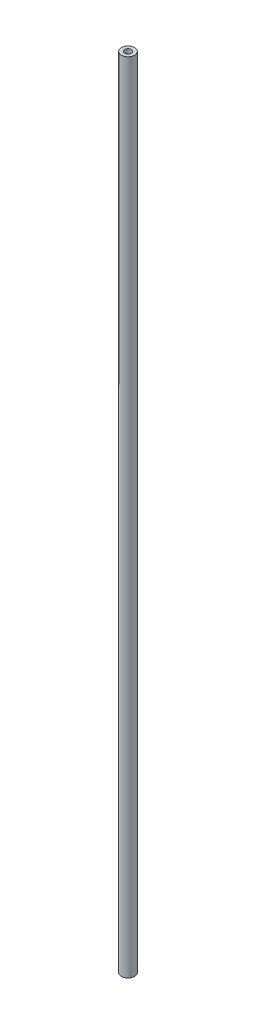
ISO-10303-21;
HEADER;
FILE_DESCRIPTION(('STEP AP214'),'2;1');
FILE_NAME('part.step','',(''),(''),'','','');
FILE_SCHEMA(('AUTOMOTIVE_DESIGN { 1 0 10303 214 1 1 1 1 }'));
ENDSEC;
DATA;
#1=APPLICATION_CONTEXT('core data for automotive mechanical design processes');
#2=APPLICATION_PROTOCOL_DEFINITION('international standard','automotive_design',2000,#1);
#3=PRODUCT_CONTEXT('',#1,'mechanical');
#4=PRODUCT('Part','Part','',(#3));
#5=PRODUCT_RELATED_PRODUCT_CATEGORY('part','',(#4));
#6=PRODUCT_DEFINITION_FORMATION('','',#4);
#7=PRODUCT_DEFINITION_CONTEXT('part definition',#1,'design');
#8=PRODUCT_DEFINITION('design','',#6,#7);
#9=PRODUCT_DEFINITION_SHAPE('','',#8);
#10=(LENGTH_UNIT() NAMED_UNIT(*) SI_UNIT(.MILLI.,.METRE.));
#11=(NAMED_UNIT(*) PLANE_ANGLE_UNIT() SI_UNIT($,.RADIAN.));
#12=(NAMED_UNIT(*) SI_UNIT($,.STERADIAN.) SOLID_ANGLE_UNIT());
#13=UNCERTAINTY_MEASURE_WITH_UNIT(LENGTH_MEASURE(1.E-05),#10,'distance_accuracy_value','');
#14=(GEOMETRIC_REPRESENTATION_CONTEXT(3) GLOBAL_UNCERTAINTY_ASSIGNED_CONTEXT((#13)) GLOBAL_UNIT_ASSIGNED_CONTEXT((#10,
#11,#12)) REPRESENTATION_CONTEXT('',''));
#15=CARTESIAN_POINT('',(0.,0.,0.));
#16=DIRECTION('',(0.,0.,1.));
#17=DIRECTION('',(1.,0.,0.));
#18=AXIS2_PLACEMENT_3D('',#15,#16,#17);
#19=CARTESIAN_POINT('',(0.,3070.098,0.));
#20=DIRECTION('',(0.,1.,0.));
#21=DIRECTION('',(0.,0.,1.));
#22=AXIS2_PLACEMENT_3D('',#19,#20,#21);
#23=PLANE('',#22);
#24=CARTESIAN_POINT('',(0.,3070.098,0.));
#25=DIRECTION('',(0.,1.,0.));
#26=DIRECTION('',(0.,0.,1.));
#27=AXIS2_PLACEMENT_3D('',#24,#25,#26);
#28=CIRCLE('',#27,25.4);
#29=CARTESIAN_POINT('',(0.,3070.098,25.4));
#30=VERTEX_POINT('',#29);
#31=EDGE_CURVE('E10',#30,#30,#28,.T.);
#32=ORIENTED_EDGE('',*,*,#31,.T.);
#33=EDGE_LOOP('',(#32));
#34=FACE_BOUND('',#33,.T.);
#35=CARTESIAN_POINT('',(0.,3070.098,0.));
#36=DIRECTION('',(0.,1.,0.));
#37=DIRECTION('',(0.,0.,1.));
#38=AXIS2_PLACEMENT_3D('',#35,#36,#37);
#39=CIRCLE('',#38,12.7);
#40=CARTESIAN_POINT('',(0.,3070.098,12.7));
#41=VERTEX_POINT('',#40);
#42=EDGE_CURVE('E52',#41,#41,#39,.T.);
#43=ORIENTED_EDGE('',*,*,#42,.F.);
#44=EDGE_LOOP('',(#43));
#45=FACE_BOUND('',#44,.T.);
#46=ADVANCED_FACE('F39',(#34,#45),#23,.T.);
#47=CARTESIAN_POINT('',(0.,0.,0.));
#48=DIRECTION('',(0.,1.,0.));
#49=DIRECTION('',(0.,0.,1.));
#50=AXIS2_PLACEMENT_3D('',#47,#48,#49);
#51=PLANE('',#50);
#52=CARTESIAN_POINT('',(0.,0.,0.));
#53=DIRECTION('',(0.,1.,0.));
#54=DIRECTION('',(0.,0.,1.));
#55=AXIS2_PLACEMENT_3D('',#52,#53,#54);
#56=CIRCLE('',#55,25.4);
#57=CARTESIAN_POINT('',(0.,0.,25.4));
#58=VERTEX_POINT('',#57);
#59=EDGE_CURVE('E43',#58,#58,#56,.T.);
#60=ORIENTED_EDGE('',*,*,#59,.F.);
#61=EDGE_LOOP('',(#60));
#62=FACE_BOUND('',#61,.T.);
#63=CARTESIAN_POINT('',(0.,0.,0.));
#64=DIRECTION('',(0.,1.,0.));
#65=DIRECTION('',(0.,0.,1.));
#66=AXIS2_PLACEMENT_3D('',#63,#64,#65);
#67=CIRCLE('',#66,12.7);
#68=CARTESIAN_POINT('',(0.,0.,12.7));
#69=VERTEX_POINT('',#68);
#70=EDGE_CURVE('E54',#69,#69,#67,.T.);
#71=ORIENTED_EDGE('',*,*,#70,.T.);
#72=EDGE_LOOP('',(#71));
#73=FACE_BOUND('',#72,.T.);
#74=ADVANCED_FACE('F66',(#62,#73),#51,.F.);
#75=CARTESIAN_POINT('',(0.,3070.098,0.));
#76=DIRECTION('',(0.,-1.,0.));
#77=DIRECTION('',(0.,0.,-1.));
#78=AXIS2_PLACEMENT_3D('',#75,#76,#77);
#79=CYLINDRICAL_SURFACE('',#78,25.4);
#80=ORIENTED_EDGE('',*,*,#31,.F.);
#81=EDGE_LOOP('',(#80));
#82=FACE_BOUND('',#81,.T.);
#83=ORIENTED_EDGE('',*,*,#59,.T.);
#84=EDGE_LOOP('',(#83));
#85=FACE_BOUND('',#84,.T.);
#86=ADVANCED_FACE('F41',(#82,#85),#79,.T.);
#87=CARTESIAN_POINT('',(0.,3070.098,0.));
#88=DIRECTION('',(0.,-1.,0.));
#89=DIRECTION('',(0.,0.,-1.));
#90=AXIS2_PLACEMENT_3D('',#87,#88,#89);
#91=CYLINDRICAL_SURFACE('',#90,12.7);
#92=ORIENTED_EDGE('',*,*,#42,.T.);
#93=EDGE_LOOP('',(#92));
#94=FACE_BOUND('',#93,.T.);
#95=ORIENTED_EDGE('',*,*,#70,.F.);
#96=EDGE_LOOP('',(#95));
#97=FACE_BOUND('',#96,.T.);
#98=ADVANCED_FACE('F62',(#94,#97),#91,.F.);
#99=CLOSED_SHELL('',(#46,#74,#86,#98));
#100=MANIFOLD_SOLID_BREP('B2',#99);
#101=ADVANCED_BREP_SHAPE_REPRESENTATION('',(#18,#100),#14);
#102=SHAPE_DEFINITION_REPRESENTATION(#9,#101);
ENDSEC;
END-ISO-10303-21;
